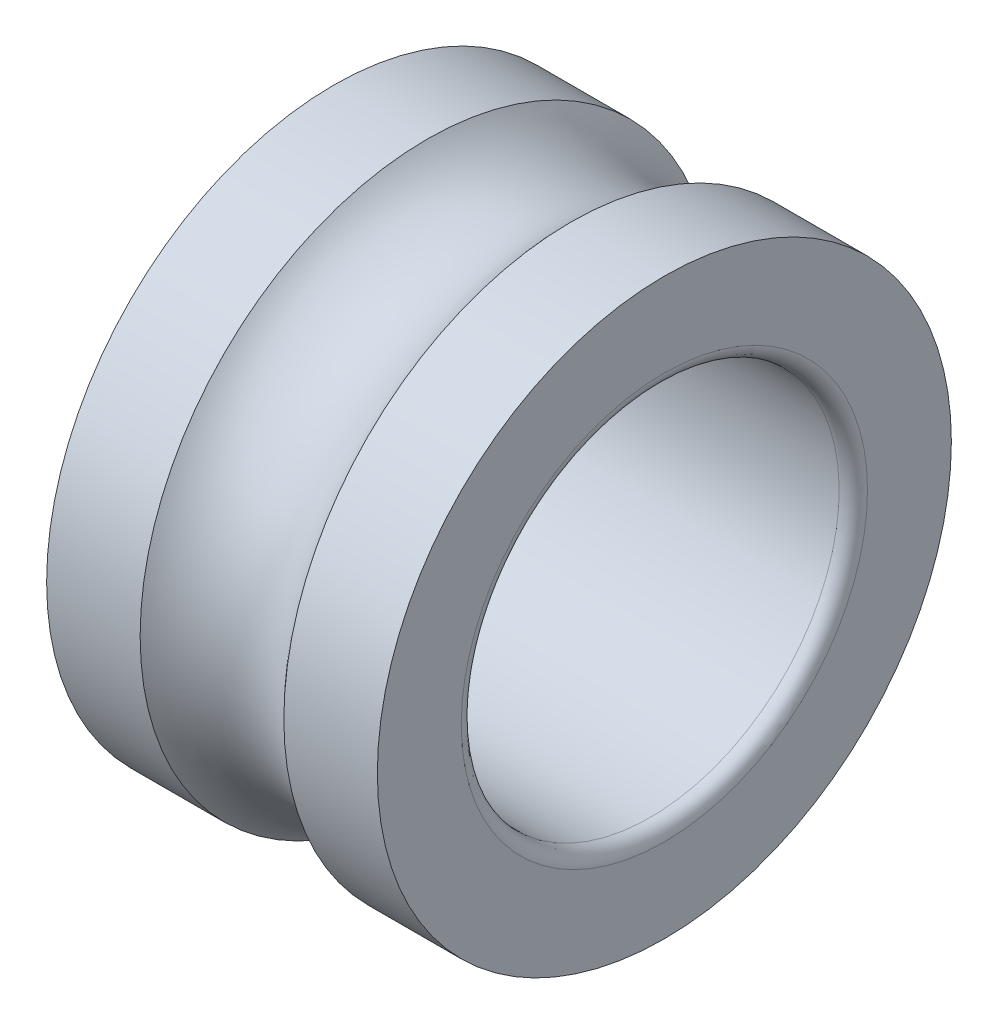
ISO-10303-21;
HEADER;
FILE_DESCRIPTION(('STEP AP214'),'2;1');
FILE_NAME('part.step','',(''),(''),'','','');
FILE_SCHEMA(('AUTOMOTIVE_DESIGN { 1 0 10303 214 1 1 1 1 }'));
ENDSEC;
DATA;
#1=APPLICATION_CONTEXT('core data for automotive mechanical design processes');
#2=APPLICATION_PROTOCOL_DEFINITION('international standard','automotive_design',2000,#1);
#3=PRODUCT_CONTEXT('',#1,'mechanical');
#4=PRODUCT('Part','Part','',(#3));
#5=PRODUCT_RELATED_PRODUCT_CATEGORY('part','',(#4));
#6=PRODUCT_DEFINITION_FORMATION('','',#4);
#7=PRODUCT_DEFINITION_CONTEXT('part definition',#1,'design');
#8=PRODUCT_DEFINITION('design','',#6,#7);
#9=PRODUCT_DEFINITION_SHAPE('','',#8);
#10=(LENGTH_UNIT() NAMED_UNIT(*) SI_UNIT(.MILLI.,.METRE.));
#11=(NAMED_UNIT(*) PLANE_ANGLE_UNIT() SI_UNIT($,.RADIAN.));
#12=(NAMED_UNIT(*) SI_UNIT($,.STERADIAN.) SOLID_ANGLE_UNIT());
#13=UNCERTAINTY_MEASURE_WITH_UNIT(LENGTH_MEASURE(1.E-05),#10,'distance_accuracy_value','');
#14=(GEOMETRIC_REPRESENTATION_CONTEXT(3) GLOBAL_UNCERTAINTY_ASSIGNED_CONTEXT((#13)) GLOBAL_UNIT_ASSIGNED_CONTEXT((#10,
#11,#12)) REPRESENTATION_CONTEXT('',''));
#15=CARTESIAN_POINT('',(0.,0.,0.));
#16=DIRECTION('',(0.,0.,1.));
#17=DIRECTION('',(1.,0.,0.));
#18=AXIS2_PLACEMENT_3D('',#15,#16,#17);
#19=CARTESIAN_POINT('',(6.0103642630345,0.,0.));
#20=DIRECTION('',(-1.,0.,0.));
#21=DIRECTION('',(0.,1.,0.));
#22=AXIS2_PLACEMENT_3D('',#19,#20,#21);
#23=CYLINDRICAL_SURFACE('',#22,6.075);
#24=CARTESIAN_POINT('',(5.020728526069,0.,0.));
#25=DIRECTION('',(1.,0.,0.));
#26=DIRECTION('',(0.,1.,0.));
#27=AXIS2_PLACEMENT_3D('',#24,#25,#26);
#28=CIRCLE('',#27,6.075);
#29=CARTESIAN_POINT('',(5.020728526069,6.075,0.));
#30=VERTEX_POINT('',#29);
#31=EDGE_CURVE('E11',#30,#30,#28,.T.);
#32=ORIENTED_EDGE('',*,*,#31,.T.);
#33=EDGE_LOOP('',(#32));
#34=FACE_BOUND('',#33,.T.);
#35=CARTESIAN_POINT('',(7.,0.,0.));
#36=DIRECTION('',(1.,0.,0.));
#37=DIRECTION('',(0.,1.,0.));
#38=AXIS2_PLACEMENT_3D('',#35,#36,#37);
#39=CIRCLE('',#38,6.075);
#40=CARTESIAN_POINT('',(7.,6.075,0.));
#41=VERTEX_POINT('',#40);
#42=EDGE_CURVE('E58',#41,#41,#39,.T.);
#43=ORIENTED_EDGE('',*,*,#42,.F.);
#44=EDGE_LOOP('',(#43));
#45=FACE_BOUND('',#44,.T.);
#46=ADVANCED_FACE('F16',(#34,#45),#23,.T.);
#47=CARTESIAN_POINT('',(3.5,0.,0.));
#48=DIRECTION('',(1.,0.,0.));
#49=DIRECTION('',(0.,0.,-1.));
#50=AXIS2_PLACEMENT_3D('',#47,#48,#49);
#51=TOROIDAL_SURFACE('',#50,7.35,1.9845);
#52=CARTESIAN_POINT('',(1.979271473931,0.,0.));
#53=DIRECTION('',(1.,0.,0.));
#54=DIRECTION('',(0.,1.,0.));
#55=AXIS2_PLACEMENT_3D('',#52,#53,#54);
#56=CIRCLE('',#55,6.075);
#57=CARTESIAN_POINT('',(1.979271473931,6.075,0.));
#58=VERTEX_POINT('',#57);
#59=EDGE_CURVE('E25',#58,#58,#56,.T.);
#60=ORIENTED_EDGE('',*,*,#59,.T.);
#61=EDGE_LOOP('',(#60));
#62=FACE_BOUND('',#61,.T.);
#63=ORIENTED_EDGE('',*,*,#31,.F.);
#64=EDGE_LOOP('',(#63));
#65=FACE_BOUND('',#64,.T.);
#66=ADVANCED_FACE('F83',(#62,#65),#51,.F.);
#67=CARTESIAN_POINT('',(0.989635736965498,0.,0.));
#68=DIRECTION('',(-1.,0.,0.));
#69=DIRECTION('',(0.,1.,0.));
#70=AXIS2_PLACEMENT_3D('',#67,#68,#69);
#71=CYLINDRICAL_SURFACE('',#70,6.075);
#72=CARTESIAN_POINT('',(0.,0.,0.));
#73=DIRECTION('',(1.,0.,0.));
#74=DIRECTION('',(0.,1.,0.));
#75=AXIS2_PLACEMENT_3D('',#72,#73,#74);
#76=CIRCLE('',#75,6.075);
#77=CARTESIAN_POINT('',(0.,6.075,0.));
#78=VERTEX_POINT('',#77);
#79=EDGE_CURVE('E57',#78,#78,#76,.T.);
#80=ORIENTED_EDGE('',*,*,#79,.T.);
#81=EDGE_LOOP('',(#80));
#82=FACE_BOUND('',#81,.T.);
#83=ORIENTED_EDGE('',*,*,#59,.F.);
#84=EDGE_LOOP('',(#83));
#85=FACE_BOUND('',#84,.T.);
#86=ADVANCED_FACE('F87',(#82,#85),#71,.T.);
#87=CARTESIAN_POINT('',(0.,5.1875,0.));
#88=DIRECTION('',(-1.,0.,0.));
#89=DIRECTION('',(0.,-1.,0.));
#90=AXIS2_PLACEMENT_3D('',#87,#88,#89);
#91=PLANE('',#90);
#92=CARTESIAN_POINT('',(0.,0.,0.));
#93=DIRECTION('',(1.,0.,0.));
#94=DIRECTION('',(0.,1.,0.));
#95=AXIS2_PLACEMENT_3D('',#92,#93,#94);
#96=CIRCLE('',#95,4.3);
#97=CARTESIAN_POINT('',(0.,4.3,0.));
#98=VERTEX_POINT('',#97);
#99=EDGE_CURVE('E20',#98,#98,#96,.T.);
#100=ORIENTED_EDGE('',*,*,#99,.T.);
#101=EDGE_LOOP('',(#100));
#102=FACE_BOUND('',#101,.T.);
#103=ORIENTED_EDGE('',*,*,#79,.F.);
#104=EDGE_LOOP('',(#103));
#105=FACE_BOUND('',#104,.T.);
#106=ADVANCED_FACE('F91',(#102,#105),#91,.T.);
#107=CARTESIAN_POINT('',(0.3,0.,0.));
#108=DIRECTION('',(1.,0.,0.));
#109=DIRECTION('',(0.,0.,-1.));
#110=AXIS2_PLACEMENT_3D('',#107,#108,#109);
#111=TOROIDAL_SURFACE('',#110,4.3,0.3);
#112=CARTESIAN_POINT('',(0.3,0.,0.));
#113=DIRECTION('',(1.,0.,0.));
#114=DIRECTION('',(0.,1.,0.));
#115=AXIS2_PLACEMENT_3D('',#112,#113,#114);
#116=CIRCLE('',#115,4.);
#117=CARTESIAN_POINT('',(0.3,4.,0.));
#118=VERTEX_POINT('',#117);
#119=EDGE_CURVE('E53',#118,#118,#116,.T.);
#120=ORIENTED_EDGE('',*,*,#119,.T.);
#121=EDGE_LOOP('',(#120));
#122=FACE_BOUND('',#121,.T.);
#123=ORIENTED_EDGE('',*,*,#99,.F.);
#124=EDGE_LOOP('',(#123));
#125=FACE_BOUND('',#124,.T.);
#126=ADVANCED_FACE('F18',(#122,#125),#111,.T.);
#127=CARTESIAN_POINT('',(3.5,0.,0.));
#128=DIRECTION('',(-1.,0.,0.));
#129=DIRECTION('',(0.,1.,0.));
#130=AXIS2_PLACEMENT_3D('',#127,#128,#129);
#131=CYLINDRICAL_SURFACE('',#130,4.);
#132=CARTESIAN_POINT('',(6.7,0.,0.));
#133=DIRECTION('',(1.,0.,0.));
#134=DIRECTION('',(0.,1.,0.));
#135=AXIS2_PLACEMENT_3D('',#132,#133,#134);
#136=CIRCLE('',#135,4.);
#137=CARTESIAN_POINT('',(6.7,4.,0.));
#138=VERTEX_POINT('',#137);
#139=EDGE_CURVE('E56',#138,#138,#136,.T.);
#140=ORIENTED_EDGE('',*,*,#139,.T.);
#141=EDGE_LOOP('',(#140));
#142=FACE_BOUND('',#141,.T.);
#143=ORIENTED_EDGE('',*,*,#119,.F.);
#144=EDGE_LOOP('',(#143));
#145=FACE_BOUND('',#144,.T.);
#146=ADVANCED_FACE('F78',(#142,#145),#131,.F.);
#147=CARTESIAN_POINT('',(6.7,0.,0.));
#148=DIRECTION('',(1.,0.,0.));
#149=DIRECTION('',(0.,0.,-1.));
#150=AXIS2_PLACEMENT_3D('',#147,#148,#149);
#151=TOROIDAL_SURFACE('',#150,4.3,0.3);
#152=CARTESIAN_POINT('',(7.,0.,0.));
#153=DIRECTION('',(1.,0.,0.));
#154=DIRECTION('',(0.,1.,0.));
#155=AXIS2_PLACEMENT_3D('',#152,#153,#154);
#156=CIRCLE('',#155,4.3);
#157=CARTESIAN_POINT('',(7.,4.3,0.));
#158=VERTEX_POINT('',#157);
#159=EDGE_CURVE('E62',#158,#158,#156,.T.);
#160=ORIENTED_EDGE('',*,*,#159,.T.);
#161=EDGE_LOOP('',(#160));
#162=FACE_BOUND('',#161,.T.);
#163=ORIENTED_EDGE('',*,*,#139,.F.);
#164=EDGE_LOOP('',(#163));
#165=FACE_BOUND('',#164,.T.);
#166=ADVANCED_FACE('F67',(#162,#165),#151,.T.);
#167=CARTESIAN_POINT('',(7.,5.1875,0.));
#168=DIRECTION('',(1.,0.,0.));
#169=DIRECTION('',(0.,1.,0.));
#170=AXIS2_PLACEMENT_3D('',#167,#168,#169);
#171=PLANE('',#170);
#172=ORIENTED_EDGE('',*,*,#42,.T.);
#173=EDGE_LOOP('',(#172));
#174=FACE_BOUND('',#173,.T.);
#175=ORIENTED_EDGE('',*,*,#159,.F.);
#176=EDGE_LOOP('',(#175));
#177=FACE_BOUND('',#176,.T.);
#178=ADVANCED_FACE('F70',(#174,#177),#171,.T.);
#179=CLOSED_SHELL('',(#46,#66,#86,#106,#126,#146,#166,#178));
#180=MANIFOLD_SOLID_BREP('B1',#179);
#181=ADVANCED_BREP_SHAPE_REPRESENTATION('',(#18,#180),#14);
#182=SHAPE_DEFINITION_REPRESENTATION(#9,#181);
ENDSEC;
END-ISO-10303-21;
